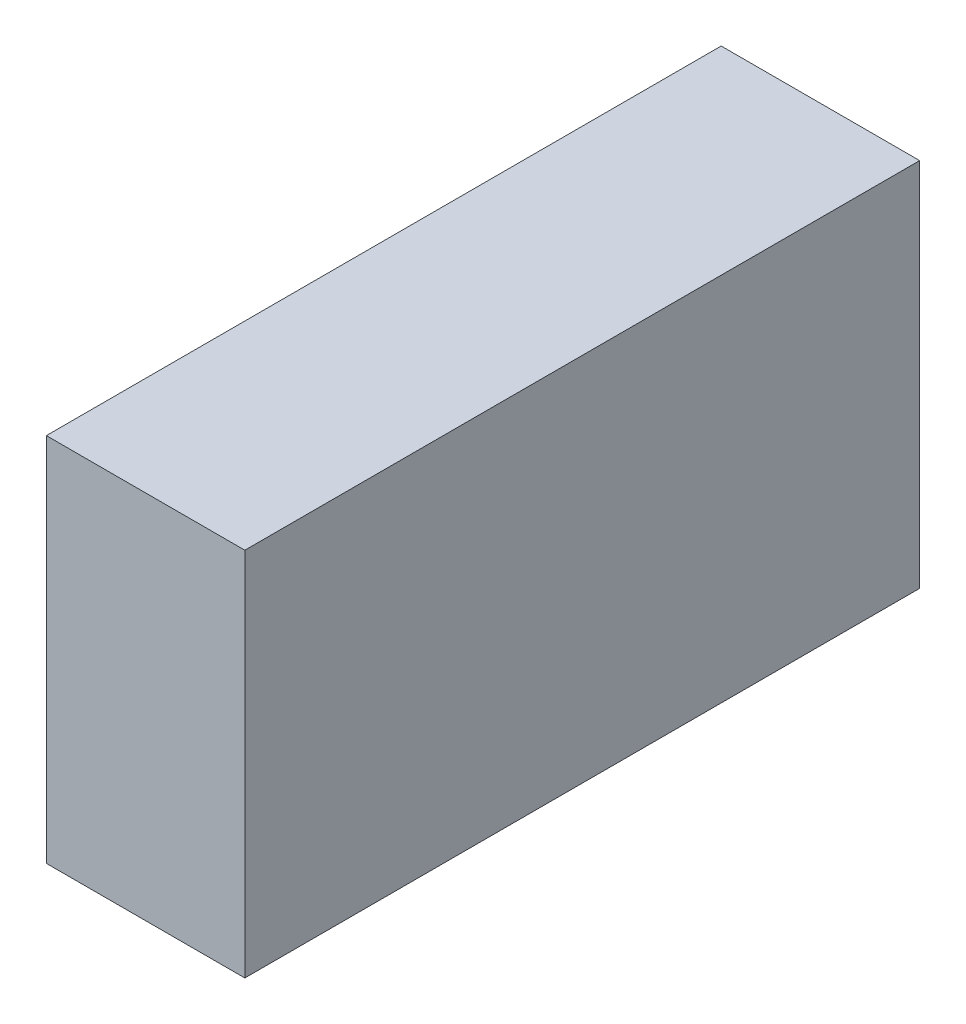
ISO-10303-21;
HEADER;
FILE_DESCRIPTION(('STEP AP214'),'2;1');
FILE_NAME('part.step','',(''),(''),'','','');
FILE_SCHEMA(('AUTOMOTIVE_DESIGN { 1 0 10303 214 1 1 1 1 }'));
ENDSEC;
DATA;
#1=APPLICATION_CONTEXT('core data for automotive mechanical design processes');
#2=APPLICATION_PROTOCOL_DEFINITION('international standard','automotive_design',2000,#1);
#3=PRODUCT_CONTEXT('',#1,'mechanical');
#4=PRODUCT('Part','Part','',(#3));
#5=PRODUCT_RELATED_PRODUCT_CATEGORY('part','',(#4));
#6=PRODUCT_DEFINITION_FORMATION('','',#4);
#7=PRODUCT_DEFINITION_CONTEXT('part definition',#1,'design');
#8=PRODUCT_DEFINITION('design','',#6,#7);
#9=PRODUCT_DEFINITION_SHAPE('','',#8);
#10=(LENGTH_UNIT() NAMED_UNIT(*) SI_UNIT(.MILLI.,.METRE.));
#11=(NAMED_UNIT(*) PLANE_ANGLE_UNIT() SI_UNIT($,.RADIAN.));
#12=(NAMED_UNIT(*) SI_UNIT($,.STERADIAN.) SOLID_ANGLE_UNIT());
#13=UNCERTAINTY_MEASURE_WITH_UNIT(LENGTH_MEASURE(1.E-05),#10,'distance_accuracy_value','');
#14=(GEOMETRIC_REPRESENTATION_CONTEXT(3) GLOBAL_UNCERTAINTY_ASSIGNED_CONTEXT((#13)) GLOBAL_UNIT_ASSIGNED_CONTEXT((#10,
#11,#12)) REPRESENTATION_CONTEXT('',''));
#15=CARTESIAN_POINT('',(0.,0.,0.));
#16=DIRECTION('',(0.,0.,1.));
#17=DIRECTION('',(1.,0.,0.));
#18=AXIS2_PLACEMENT_3D('',#15,#16,#17);
#19=CARTESIAN_POINT('',(7.5,28.,25.5));
#20=DIRECTION('',(-1.,0.,0.));
#21=DIRECTION('',(0.,0.,1.));
#22=AXIS2_PLACEMENT_3D('',#19,#20,#21);
#23=PLANE('',#22);
#24=DIRECTION('',(0.,0.,-1.));
#25=VECTOR('',#24,1.);
#26=CARTESIAN_POINT('',(7.5,0.,25.5));
#27=LINE('',#26,#25);
#28=CARTESIAN_POINT('',(7.5,0.,25.5));
#29=VERTEX_POINT('',#28);
#30=CARTESIAN_POINT('',(7.5,0.,-25.5));
#31=VERTEX_POINT('',#30);
#32=EDGE_CURVE('E111',#29,#31,#27,.T.);
#33=ORIENTED_EDGE('',*,*,#32,.T.);
#34=DIRECTION('',(0.,-1.,0.));
#35=VECTOR('',#34,1.);
#36=CARTESIAN_POINT('',(7.5,28.,-25.5));
#37=LINE('',#36,#35);
#38=CARTESIAN_POINT('',(7.5,28.,-25.5));
#39=VERTEX_POINT('',#38);
#40=EDGE_CURVE('E11',#39,#31,#37,.T.);
#41=ORIENTED_EDGE('',*,*,#40,.F.);
#42=DIRECTION('',(0.,0.,-1.));
#43=VECTOR('',#42,1.);
#44=CARTESIAN_POINT('',(7.5,28.,25.5));
#45=LINE('',#44,#43);
#46=CARTESIAN_POINT('',(7.5,28.,25.5));
#47=VERTEX_POINT('',#46);
#48=EDGE_CURVE('E95',#47,#39,#45,.T.);
#49=ORIENTED_EDGE('',*,*,#48,.F.);
#50=DIRECTION('',(0.,-1.,0.));
#51=VECTOR('',#50,1.);
#52=CARTESIAN_POINT('',(7.5,28.,25.5));
#53=LINE('',#52,#51);
#54=EDGE_CURVE('E107',#47,#29,#53,.T.);
#55=ORIENTED_EDGE('',*,*,#54,.T.);
#56=EDGE_LOOP('',(#33,#41,#49,#55));
#57=FACE_BOUND('',#56,.T.);
#58=ADVANCED_FACE('F43',(#57),#23,.F.);
#59=CARTESIAN_POINT('',(-7.5,28.,-25.5));
#60=DIRECTION('',(0.,0.,1.));
#61=DIRECTION('',(1.,0.,0.));
#62=AXIS2_PLACEMENT_3D('',#59,#60,#61);
#63=PLANE('',#62);
#64=DIRECTION('',(-1.,0.,0.));
#65=VECTOR('',#64,1.);
#66=CARTESIAN_POINT('',(-7.5,0.,-25.5));
#67=LINE('',#66,#65);
#68=CARTESIAN_POINT('',(-7.5,0.,-25.5));
#69=VERTEX_POINT('',#68);
#70=EDGE_CURVE('E100',#31,#69,#67,.T.);
#71=ORIENTED_EDGE('',*,*,#70,.T.);
#72=DIRECTION('',(0.,-1.,0.));
#73=VECTOR('',#72,1.);
#74=CARTESIAN_POINT('',(-7.5,28.,-25.5));
#75=LINE('',#74,#73);
#76=CARTESIAN_POINT('',(-7.5,28.,-25.5));
#77=VERTEX_POINT('',#76);
#78=EDGE_CURVE('E52',#77,#69,#75,.T.);
#79=ORIENTED_EDGE('',*,*,#78,.F.);
#80=DIRECTION('',(-1.,0.,0.));
#81=VECTOR('',#80,1.);
#82=CARTESIAN_POINT('',(-7.5,28.,-25.5));
#83=LINE('',#82,#81);
#84=EDGE_CURVE('E90',#39,#77,#83,.T.);
#85=ORIENTED_EDGE('',*,*,#84,.F.);
#86=ORIENTED_EDGE('',*,*,#40,.T.);
#87=EDGE_LOOP('',(#71,#79,#85,#86));
#88=FACE_BOUND('',#87,.T.);
#89=ADVANCED_FACE('F99',(#88),#63,.F.);
#90=CARTESIAN_POINT('',(-7.5,28.,25.5));
#91=DIRECTION('',(1.,0.,0.));
#92=DIRECTION('',(0.,0.,-1.));
#93=AXIS2_PLACEMENT_3D('',#90,#91,#92);
#94=PLANE('',#93);
#95=DIRECTION('',(0.,0.,1.));
#96=VECTOR('',#95,1.);
#97=CARTESIAN_POINT('',(-7.5,0.,25.5));
#98=LINE('',#97,#96);
#99=CARTESIAN_POINT('',(-7.5,0.,25.5));
#100=VERTEX_POINT('',#99);
#101=EDGE_CURVE('E77',#69,#100,#98,.T.);
#102=ORIENTED_EDGE('',*,*,#101,.T.);
#103=DIRECTION('',(0.,-1.,0.));
#104=VECTOR('',#103,1.);
#105=CARTESIAN_POINT('',(-7.5,28.,25.5));
#106=LINE('',#105,#104);
#107=CARTESIAN_POINT('',(-7.5,28.,25.5));
#108=VERTEX_POINT('',#107);
#109=EDGE_CURVE('E102',#108,#100,#106,.T.);
#110=ORIENTED_EDGE('',*,*,#109,.F.);
#111=DIRECTION('',(0.,0.,1.));
#112=VECTOR('',#111,1.);
#113=CARTESIAN_POINT('',(-7.5,28.,25.5));
#114=LINE('',#113,#112);
#115=EDGE_CURVE('E93',#77,#108,#114,.T.);
#116=ORIENTED_EDGE('',*,*,#115,.F.);
#117=ORIENTED_EDGE('',*,*,#78,.T.);
#118=EDGE_LOOP('',(#102,#110,#116,#117));
#119=FACE_BOUND('',#118,.T.);
#120=ADVANCED_FACE('F103',(#119),#94,.F.);
#121=CARTESIAN_POINT('',(-7.5,28.,25.5));
#122=DIRECTION('',(0.,0.,-1.));
#123=DIRECTION('',(-1.,0.,0.));
#124=AXIS2_PLACEMENT_3D('',#121,#122,#123);
#125=PLANE('',#124);
#126=DIRECTION('',(1.,0.,0.));
#127=VECTOR('',#126,1.);
#128=CARTESIAN_POINT('',(-7.5,0.,25.5));
#129=LINE('',#128,#127);
#130=EDGE_CURVE('E83',#100,#29,#129,.T.);
#131=ORIENTED_EDGE('',*,*,#130,.T.);
#132=ORIENTED_EDGE('',*,*,#54,.F.);
#133=DIRECTION('',(1.,0.,0.));
#134=VECTOR('',#133,1.);
#135=CARTESIAN_POINT('',(-7.5,28.,25.5));
#136=LINE('',#135,#134);
#137=EDGE_CURVE('E60',#108,#47,#136,.T.);
#138=ORIENTED_EDGE('',*,*,#137,.F.);
#139=ORIENTED_EDGE('',*,*,#109,.T.);
#140=EDGE_LOOP('',(#131,#132,#138,#139));
#141=FACE_BOUND('',#140,.T.);
#142=ADVANCED_FACE('F124',(#141),#125,.F.);
#143=CARTESIAN_POINT('',(0.,28.,0.));
#144=DIRECTION('',(0.,-1.,0.));
#145=DIRECTION('',(0.,0.,-1.));
#146=AXIS2_PLACEMENT_3D('',#143,#144,#145);
#147=PLANE('',#146);
#148=ORIENTED_EDGE('',*,*,#48,.T.);
#149=ORIENTED_EDGE('',*,*,#84,.T.);
#150=ORIENTED_EDGE('',*,*,#115,.T.);
#151=ORIENTED_EDGE('',*,*,#137,.T.);
#152=EDGE_LOOP('',(#148,#149,#150,#151));
#153=FACE_BOUND('',#152,.T.);
#154=ADVANCED_FACE('F91',(#153),#147,.F.);
#155=CARTESIAN_POINT('',(0.,0.,0.));
#156=DIRECTION('',(0.,-1.,0.));
#157=DIRECTION('',(0.,0.,-1.));
#158=AXIS2_PLACEMENT_3D('',#155,#156,#157);
#159=PLANE('',#158);
#160=ORIENTED_EDGE('',*,*,#32,.F.);
#161=ORIENTED_EDGE('',*,*,#130,.F.);
#162=ORIENTED_EDGE('',*,*,#101,.F.);
#163=ORIENTED_EDGE('',*,*,#70,.F.);
#164=EDGE_LOOP('',(#160,#161,#162,#163));
#165=FACE_BOUND('',#164,.T.);
#166=ADVANCED_FACE('F127',(#165),#159,.T.);
#167=CLOSED_SHELL('',(#58,#89,#120,#142,#154,#166));
#168=MANIFOLD_SOLID_BREP('B2',#167);
#169=ADVANCED_BREP_SHAPE_REPRESENTATION('',(#18,#168),#14);
#170=SHAPE_DEFINITION_REPRESENTATION(#9,#169);
ENDSEC;
END-ISO-10303-21;
